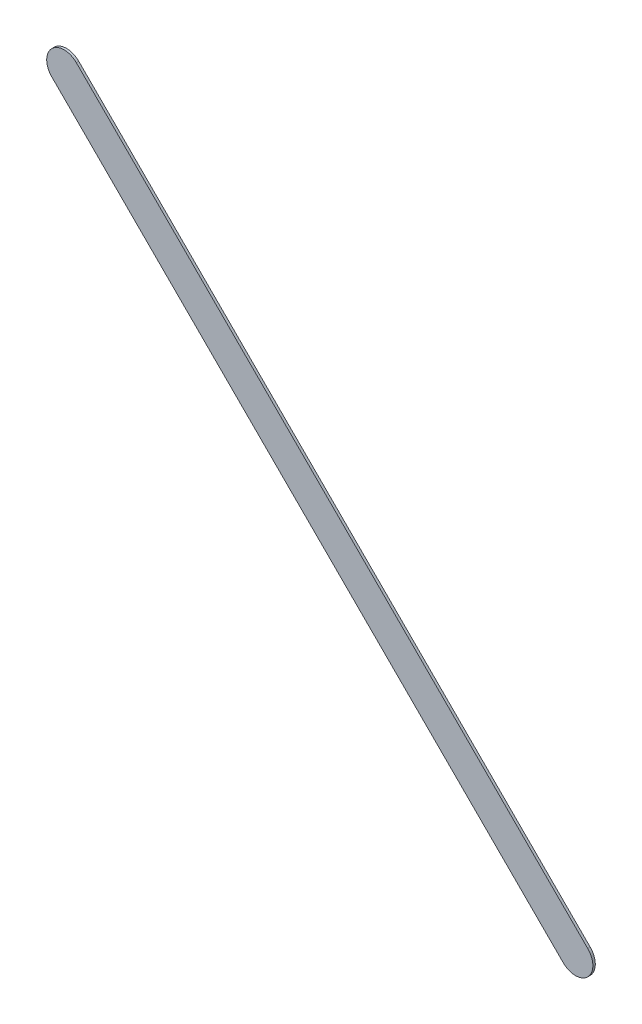
ISO-10303-21;
HEADER;
FILE_DESCRIPTION(('STEP AP214'),'2;1');
FILE_NAME('part.step','',(''),(''),'','','');
FILE_SCHEMA(('AUTOMOTIVE_DESIGN { 1 0 10303 214 1 1 1 1 }'));
ENDSEC;
DATA;
#1=APPLICATION_CONTEXT('core data for automotive mechanical design processes');
#2=APPLICATION_PROTOCOL_DEFINITION('international standard','automotive_design',2000,#1);
#3=PRODUCT_CONTEXT('',#1,'mechanical');
#4=PRODUCT('Part','Part','',(#3));
#5=PRODUCT_RELATED_PRODUCT_CATEGORY('part','',(#4));
#6=PRODUCT_DEFINITION_FORMATION('','',#4);
#7=PRODUCT_DEFINITION_CONTEXT('part definition',#1,'design');
#8=PRODUCT_DEFINITION('design','',#6,#7);
#9=PRODUCT_DEFINITION_SHAPE('','',#8);
#10=(LENGTH_UNIT() NAMED_UNIT(*) SI_UNIT(.MILLI.,.METRE.));
#11=(NAMED_UNIT(*) PLANE_ANGLE_UNIT() SI_UNIT($,.RADIAN.));
#12=(NAMED_UNIT(*) SI_UNIT($,.STERADIAN.) SOLID_ANGLE_UNIT());
#13=UNCERTAINTY_MEASURE_WITH_UNIT(LENGTH_MEASURE(1.E-05),#10,'distance_accuracy_value','');
#14=(GEOMETRIC_REPRESENTATION_CONTEXT(3) GLOBAL_UNCERTAINTY_ASSIGNED_CONTEXT((#13)) GLOBAL_UNIT_ASSIGNED_CONTEXT((#10,
#11,#12)) REPRESENTATION_CONTEXT('',''));
#15=CARTESIAN_POINT('',(0.,0.,0.));
#16=DIRECTION('',(0.,0.,1.));
#17=DIRECTION('',(1.,0.,0.));
#18=AXIS2_PLACEMENT_3D('',#15,#16,#17);
#19=CARTESIAN_POINT('',(157.303223,-107.364776,0.));
#20=DIRECTION('',(0.,0.,1.));
#21=DIRECTION('',(1.,0.,0.));
#22=AXIS2_PLACEMENT_3D('',#19,#20,#21);
#23=PLANE('',#22);
#24=DIRECTION('',(0.707106781186548,-0.707106781186548,0.));
#25=VECTOR('',#24,1.);
#26=CARTESIAN_POINT('',(157.303223,-107.364776,0.));
#27=LINE('',#26,#25);
#28=CARTESIAN_POINT('',(157.303223,-107.364776,0.));
#29=VERTEX_POINT('',#28);
#30=CARTESIAN_POINT('',(164.669223,-114.730776,0.));
#31=VERTEX_POINT('',#30);
#32=EDGE_CURVE('E75',#29,#31,#27,.T.);
#33=ORIENTED_EDGE('',*,*,#32,.T.);
#34=CARTESIAN_POINT('',(164.8459995,-114.5539995,0.));
#35=DIRECTION('',(0.,0.,1.));
#36=DIRECTION('',(-0.707106781186548,-0.707106781186548,0.));
#37=AXIS2_PLACEMENT_3D('',#34,#35,#36);
#38=CIRCLE('',#37,0.249999723809);
#39=CARTESIAN_POINT('',(165.022776,-114.377223,0.));
#40=VERTEX_POINT('',#39);
#41=EDGE_CURVE('E73',#31,#40,#38,.T.);
#42=ORIENTED_EDGE('',*,*,#41,.T.);
#43=DIRECTION('',(-0.707106781186548,0.707106781186548,0.));
#44=VECTOR('',#43,1.);
#45=CARTESIAN_POINT('',(165.022776,-114.377223,0.));
#46=LINE('',#45,#44);
#47=CARTESIAN_POINT('',(157.656776,-107.011223,0.));
#48=VERTEX_POINT('',#47);
#49=EDGE_CURVE('E61',#40,#48,#46,.T.);
#50=ORIENTED_EDGE('',*,*,#49,.T.);
#51=CARTESIAN_POINT('',(157.4799995,-107.1879995,0.));
#52=DIRECTION('',(0.,0.,1.));
#53=DIRECTION('',(0.707106781186548,0.707106781186548,0.));
#54=AXIS2_PLACEMENT_3D('',#51,#52,#53);
#55=CIRCLE('',#54,0.249999723809);
#56=EDGE_CURVE('E11',#48,#29,#55,.T.);
#57=ORIENTED_EDGE('',*,*,#56,.T.);
#58=EDGE_LOOP('',(#33,#42,#50,#57));
#59=FACE_BOUND('',#58,.T.);
#60=ADVANCED_FACE('F17',(#59),#23,.T.);
#61=CARTESIAN_POINT('',(157.303223,-107.364776,-0.035));
#62=DIRECTION('',(0.,0.,1.));
#63=DIRECTION('',(1.,0.,0.));
#64=AXIS2_PLACEMENT_3D('',#61,#62,#63);
#65=PLANE('',#64);
#66=CARTESIAN_POINT('',(157.4799995,-107.1879995,-0.035));
#67=DIRECTION('',(0.,0.,1.));
#68=DIRECTION('',(0.707106781186548,0.707106781186548,0.));
#69=AXIS2_PLACEMENT_3D('',#66,#67,#68);
#70=CIRCLE('',#69,0.249999723809);
#71=CARTESIAN_POINT('',(157.656776,-107.011223,-0.035));
#72=VERTEX_POINT('',#71);
#73=CARTESIAN_POINT('',(157.303223,-107.364776,-0.035));
#74=VERTEX_POINT('',#73);
#75=EDGE_CURVE('E27',#72,#74,#70,.T.);
#76=ORIENTED_EDGE('',*,*,#75,.F.);
#77=DIRECTION('',(-0.707106781186548,0.707106781186548,0.));
#78=VECTOR('',#77,1.);
#79=CARTESIAN_POINT('',(165.022776,-114.377223,-0.035));
#80=LINE('',#79,#78);
#81=CARTESIAN_POINT('',(165.022776,-114.377223,-0.035));
#82=VERTEX_POINT('',#81);
#83=EDGE_CURVE('E80',#82,#72,#80,.T.);
#84=ORIENTED_EDGE('',*,*,#83,.F.);
#85=CARTESIAN_POINT('',(164.8459995,-114.5539995,-0.035));
#86=DIRECTION('',(0.,0.,1.));
#87=DIRECTION('',(-0.707106781186548,-0.707106781186548,0.));
#88=AXIS2_PLACEMENT_3D('',#85,#86,#87);
#89=CIRCLE('',#88,0.249999723809);
#90=CARTESIAN_POINT('',(164.669223,-114.730776,-0.035));
#91=VERTEX_POINT('',#90);
#92=EDGE_CURVE('E84',#91,#82,#89,.T.);
#93=ORIENTED_EDGE('',*,*,#92,.F.);
#94=DIRECTION('',(0.707106781186548,-0.707106781186548,0.));
#95=VECTOR('',#94,1.);
#96=CARTESIAN_POINT('',(157.303223,-107.364776,-0.035));
#97=LINE('',#96,#95);
#98=EDGE_CURVE('E111',#74,#91,#97,.T.);
#99=ORIENTED_EDGE('',*,*,#98,.F.);
#100=EDGE_LOOP('',(#76,#84,#93,#99));
#101=FACE_BOUND('',#100,.T.);
#102=ADVANCED_FACE('F19',(#101),#65,.F.);
#103=CARTESIAN_POINT('',(157.4799995,-107.1879995,-0.035));
#104=DIRECTION('',(0.,0.,-1.));
#105=DIRECTION('',(0.707106781186548,0.707106781186548,0.));
#106=AXIS2_PLACEMENT_3D('',#103,#104,#105);
#107=CYLINDRICAL_SURFACE('',#106,0.249999723809);
#108=ORIENTED_EDGE('',*,*,#75,.T.);
#109=DIRECTION('',(0.,0.,1.));
#110=VECTOR('',#109,1.);
#111=CARTESIAN_POINT('',(157.303223,-107.364776,-0.035));
#112=LINE('',#111,#110);
#113=EDGE_CURVE('E91',#74,#29,#112,.T.);
#114=ORIENTED_EDGE('',*,*,#113,.T.);
#115=ORIENTED_EDGE('',*,*,#56,.F.);
#116=DIRECTION('',(0.,0.,1.));
#117=VECTOR('',#116,1.);
#118=CARTESIAN_POINT('',(157.656776,-107.011223,-0.035));
#119=LINE('',#118,#117);
#120=EDGE_CURVE('E68',#72,#48,#119,.T.);
#121=ORIENTED_EDGE('',*,*,#120,.F.);
#122=EDGE_LOOP('',(#108,#114,#115,#121));
#123=FACE_BOUND('',#122,.T.);
#124=ADVANCED_FACE('F104',(#123),#107,.T.);
#125=CARTESIAN_POINT('',(165.022776,-114.377223,-0.035));
#126=DIRECTION('',(-0.707106781186548,-0.707106781186548,0.));
#127=DIRECTION('',(-0.707106781186548,0.707106781186548,0.));
#128=AXIS2_PLACEMENT_3D('',#125,#126,#127);
#129=PLANE('',#128);
#130=ORIENTED_EDGE('',*,*,#83,.T.);
#131=ORIENTED_EDGE('',*,*,#120,.T.);
#132=ORIENTED_EDGE('',*,*,#49,.F.);
#133=DIRECTION('',(0.,0.,1.));
#134=VECTOR('',#133,1.);
#135=CARTESIAN_POINT('',(165.022776,-114.377223,-0.035));
#136=LINE('',#135,#134);
#137=EDGE_CURVE('E66',#82,#40,#136,.T.);
#138=ORIENTED_EDGE('',*,*,#137,.F.);
#139=EDGE_LOOP('',(#130,#131,#132,#138));
#140=FACE_BOUND('',#139,.T.);
#141=ADVANCED_FACE('F64',(#140),#129,.F.);
#142=CARTESIAN_POINT('',(164.8459995,-114.5539995,-0.035));
#143=DIRECTION('',(0.,0.,-1.));
#144=DIRECTION('',(-0.707106781186548,-0.707106781186548,0.));
#145=AXIS2_PLACEMENT_3D('',#142,#143,#144);
#146=CYLINDRICAL_SURFACE('',#145,0.249999723809);
#147=ORIENTED_EDGE('',*,*,#92,.T.);
#148=ORIENTED_EDGE('',*,*,#137,.T.);
#149=ORIENTED_EDGE('',*,*,#41,.F.);
#150=DIRECTION('',(0.,0.,1.));
#151=VECTOR('',#150,1.);
#152=CARTESIAN_POINT('',(164.669223,-114.730776,-0.035));
#153=LINE('',#152,#151);
#154=EDGE_CURVE('E114',#91,#31,#153,.T.);
#155=ORIENTED_EDGE('',*,*,#154,.F.);
#156=EDGE_LOOP('',(#147,#148,#149,#155));
#157=FACE_BOUND('',#156,.T.);
#158=ADVANCED_FACE('F82',(#157),#146,.T.);
#159=CARTESIAN_POINT('',(157.303223,-107.364776,-0.035));
#160=DIRECTION('',(0.707106781186548,0.707106781186548,0.));
#161=DIRECTION('',(0.,0.,-1.));
#162=AXIS2_PLACEMENT_3D('',#159,#160,#161);
#163=PLANE('',#162);
#164=ORIENTED_EDGE('',*,*,#98,.T.);
#165=ORIENTED_EDGE('',*,*,#154,.T.);
#166=ORIENTED_EDGE('',*,*,#32,.F.);
#167=ORIENTED_EDGE('',*,*,#113,.F.);
#168=EDGE_LOOP('',(#164,#165,#166,#167));
#169=FACE_BOUND('',#168,.T.);
#170=ADVANCED_FACE('F110',(#169),#163,.F.);
#171=CLOSED_SHELL('',(#60,#102,#124,#141,#158,#170));
#172=MANIFOLD_SOLID_BREP('B1',#171);
#173=ADVANCED_BREP_SHAPE_REPRESENTATION('',(#18,#172),#14);
#174=SHAPE_DEFINITION_REPRESENTATION(#9,#173);
ENDSEC;
END-ISO-10303-21;
